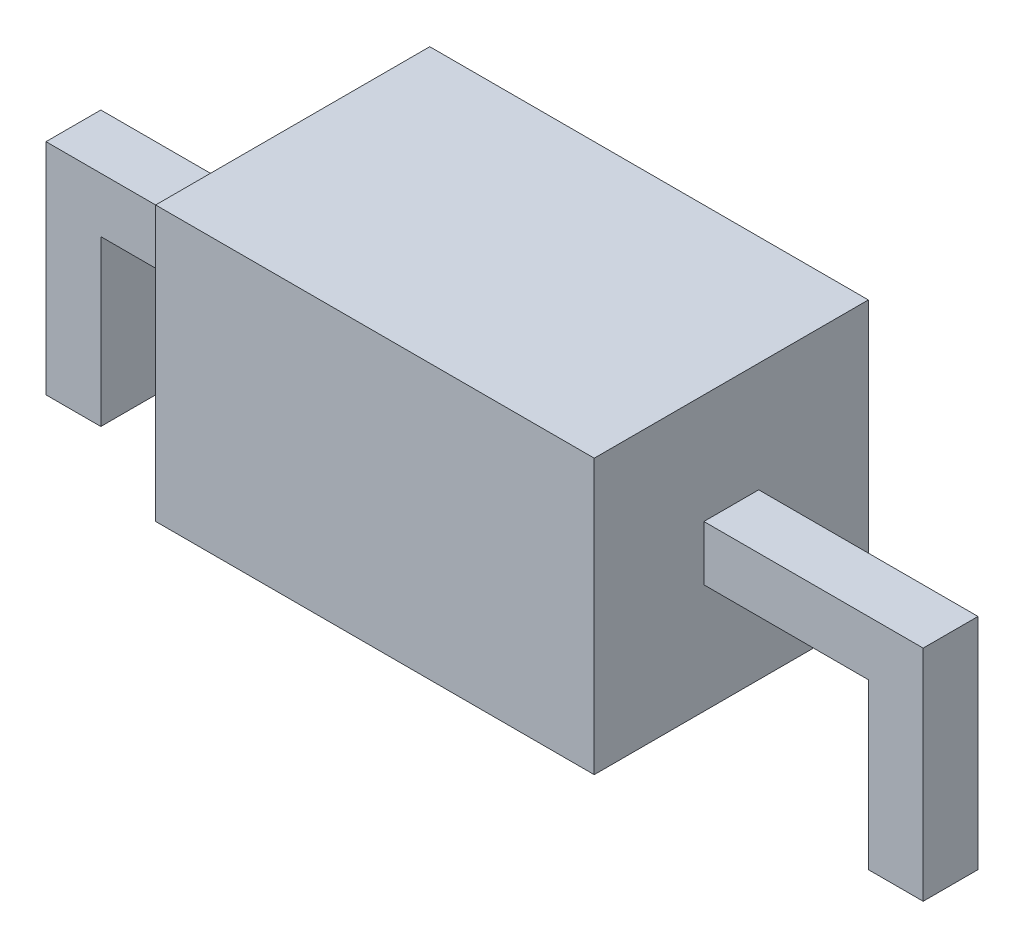
ISO-10303-21;
HEADER;
FILE_DESCRIPTION(('STEP AP214'),'2;1');
FILE_NAME('part.step','',(''),(''),'','','');
FILE_SCHEMA(('AUTOMOTIVE_DESIGN { 1 0 10303 214 1 1 1 1 }'));
ENDSEC;
DATA;
#1=APPLICATION_CONTEXT('core data for automotive mechanical design processes');
#2=APPLICATION_PROTOCOL_DEFINITION('international standard','automotive_design',2000,#1);
#3=PRODUCT_CONTEXT('',#1,'mechanical');
#4=PRODUCT('Part','Part','',(#3));
#5=PRODUCT_RELATED_PRODUCT_CATEGORY('part','',(#4));
#6=PRODUCT_DEFINITION_FORMATION('','',#4);
#7=PRODUCT_DEFINITION_CONTEXT('part definition',#1,'design');
#8=PRODUCT_DEFINITION('design','',#6,#7);
#9=PRODUCT_DEFINITION_SHAPE('','',#8);
#10=(LENGTH_UNIT() NAMED_UNIT(*) SI_UNIT(.MILLI.,.METRE.));
#11=(NAMED_UNIT(*) PLANE_ANGLE_UNIT() SI_UNIT($,.RADIAN.));
#12=(NAMED_UNIT(*) SI_UNIT($,.STERADIAN.) SOLID_ANGLE_UNIT());
#13=UNCERTAINTY_MEASURE_WITH_UNIT(LENGTH_MEASURE(1.E-05),#10,'distance_accuracy_value','');
#14=(GEOMETRIC_REPRESENTATION_CONTEXT(3) GLOBAL_UNCERTAINTY_ASSIGNED_CONTEXT((#13)) GLOBAL_UNIT_ASSIGNED_CONTEXT((#10,
#11,#12)) REPRESENTATION_CONTEXT('',''));
#15=CARTESIAN_POINT('',(0.,0.,0.));
#16=DIRECTION('',(0.,0.,1.));
#17=DIRECTION('',(1.,0.,0.));
#18=AXIS2_PLACEMENT_3D('',#15,#16,#17);
#19=CARTESIAN_POINT('',(2.,1.25,2.5));
#20=DIRECTION('',(-1.,0.,0.));
#21=DIRECTION('',(0.,0.,1.));
#22=AXIS2_PLACEMENT_3D('',#19,#20,#21);
#23=PLANE('',#22);
#24=DIRECTION('',(0.,-1.,0.));
#25=VECTOR('',#24,1.);
#26=CARTESIAN_POINT('',(2.,0.,1.));
#27=LINE('',#26,#25);
#28=CARTESIAN_POINT('',(2.,0.25,1.));
#29=VERTEX_POINT('',#28);
#30=CARTESIAN_POINT('',(2.,-0.25,1.));
#31=VERTEX_POINT('',#30);
#32=EDGE_CURVE('E263',#29,#31,#27,.T.);
#33=ORIENTED_EDGE('',*,*,#32,.T.);
#34=DIRECTION('',(0.,0.,1.));
#35=VECTOR('',#34,1.);
#36=CARTESIAN_POINT('',(2.,-0.25,1.));
#37=LINE('',#36,#35);
#38=CARTESIAN_POINT('',(2.,-0.25,1.5));
#39=VERTEX_POINT('',#38);
#40=EDGE_CURVE('E268',#31,#39,#37,.T.);
#41=ORIENTED_EDGE('',*,*,#40,.T.);
#42=DIRECTION('',(0.,-1.,0.));
#43=VECTOR('',#42,1.);
#44=CARTESIAN_POINT('',(2.,0.,1.5));
#45=LINE('',#44,#43);
#46=CARTESIAN_POINT('',(2.,0.25,1.5));
#47=VERTEX_POINT('',#46);
#48=EDGE_CURVE('E242',#47,#39,#45,.T.);
#49=ORIENTED_EDGE('',*,*,#48,.F.);
#50=DIRECTION('',(0.,0.,1.));
#51=VECTOR('',#50,1.);
#52=CARTESIAN_POINT('',(2.,0.25,1.));
#53=LINE('',#52,#51);
#54=EDGE_CURVE('E273',#29,#47,#53,.T.);
#55=ORIENTED_EDGE('',*,*,#54,.F.);
#56=EDGE_LOOP('',(#33,#41,#49,#55));
#57=FACE_BOUND('',#56,.T.);
#58=DIRECTION('',(0.,1.,0.));
#59=VECTOR('',#58,1.);
#60=CARTESIAN_POINT('',(2.,1.25,0.));
#61=LINE('',#60,#59);
#62=CARTESIAN_POINT('',(2.,-1.25,0.));
#63=VERTEX_POINT('',#62);
#64=CARTESIAN_POINT('',(2.,1.25,0.));
#65=VERTEX_POINT('',#64);
#66=EDGE_CURVE('E272',#63,#65,#61,.T.);
#67=ORIENTED_EDGE('',*,*,#66,.T.);
#68=DIRECTION('',(0.,0.,-1.));
#69=VECTOR('',#68,1.);
#70=CARTESIAN_POINT('',(2.,1.25,2.5));
#71=LINE('',#70,#69);
#72=CARTESIAN_POINT('',(2.,1.25,2.5));
#73=VERTEX_POINT('',#72);
#74=EDGE_CURVE('E11',#73,#65,#71,.T.);
#75=ORIENTED_EDGE('',*,*,#74,.F.);
#76=DIRECTION('',(0.,1.,0.));
#77=VECTOR('',#76,1.);
#78=CARTESIAN_POINT('',(2.,1.25,2.5));
#79=LINE('',#78,#77);
#80=CARTESIAN_POINT('',(2.,-1.25,2.5));
#81=VERTEX_POINT('',#80);
#82=EDGE_CURVE('E287',#81,#73,#79,.T.);
#83=ORIENTED_EDGE('',*,*,#82,.F.);
#84=DIRECTION('',(0.,0.,-1.));
#85=VECTOR('',#84,1.);
#86=CARTESIAN_POINT('',(2.,-1.25,2.5));
#87=LINE('',#86,#85);
#88=EDGE_CURVE('E301',#81,#63,#87,.T.);
#89=ORIENTED_EDGE('',*,*,#88,.T.);
#90=EDGE_LOOP('',(#67,#75,#83,#89));
#91=FACE_BOUND('',#90,.T.);
#92=ADVANCED_FACE('F41',(#57,#91),#23,.F.);
#93=CARTESIAN_POINT('',(-2.,1.25,2.5));
#94=DIRECTION('',(0.,-1.,0.));
#95=DIRECTION('',(0.,0.,-1.));
#96=AXIS2_PLACEMENT_3D('',#93,#94,#95);
#97=PLANE('',#96);
#98=DIRECTION('',(-1.,0.,0.));
#99=VECTOR('',#98,1.);
#100=CARTESIAN_POINT('',(-2.,1.25,0.));
#101=LINE('',#100,#99);
#102=CARTESIAN_POINT('',(-2.,1.25,0.));
#103=VERTEX_POINT('',#102);
#104=EDGE_CURVE('E305',#65,#103,#101,.T.);
#105=ORIENTED_EDGE('',*,*,#104,.T.);
#106=DIRECTION('',(0.,0.,-1.));
#107=VECTOR('',#106,1.);
#108=CARTESIAN_POINT('',(-2.,1.25,2.5));
#109=LINE('',#108,#107);
#110=CARTESIAN_POINT('',(-2.,1.25,2.5));
#111=VERTEX_POINT('',#110);
#112=EDGE_CURVE('E49',#111,#103,#109,.T.);
#113=ORIENTED_EDGE('',*,*,#112,.F.);
#114=DIRECTION('',(-1.,0.,0.));
#115=VECTOR('',#114,1.);
#116=CARTESIAN_POINT('',(-2.,1.25,2.5));
#117=LINE('',#116,#115);
#118=EDGE_CURVE('E291',#73,#111,#117,.T.);
#119=ORIENTED_EDGE('',*,*,#118,.F.);
#120=ORIENTED_EDGE('',*,*,#74,.T.);
#121=EDGE_LOOP('',(#105,#113,#119,#120));
#122=FACE_BOUND('',#121,.T.);
#123=ADVANCED_FACE('F341',(#122),#97,.F.);
#124=CARTESIAN_POINT('',(-2.,1.25,2.5));
#125=DIRECTION('',(1.,0.,0.));
#126=DIRECTION('',(0.,1.,0.));
#127=AXIS2_PLACEMENT_3D('',#124,#125,#126);
#128=PLANE('',#127);
#129=DIRECTION('',(0.,-1.,0.));
#130=VECTOR('',#129,1.);
#131=CARTESIAN_POINT('',(-2.,0.,1.));
#132=LINE('',#131,#130);
#133=CARTESIAN_POINT('',(-2.,0.25,1.));
#134=VERTEX_POINT('',#133);
#135=CARTESIAN_POINT('',(-2.,-0.25,1.));
#136=VERTEX_POINT('',#135);
#137=EDGE_CURVE('E190',#134,#136,#132,.T.);
#138=ORIENTED_EDGE('',*,*,#137,.F.);
#139=DIRECTION('',(0.,0.,1.));
#140=VECTOR('',#139,1.);
#141=CARTESIAN_POINT('',(-2.,0.25,1.));
#142=LINE('',#141,#140);
#143=CARTESIAN_POINT('',(-2.,0.25,1.5));
#144=VERTEX_POINT('',#143);
#145=EDGE_CURVE('E56',#134,#144,#142,.T.);
#146=ORIENTED_EDGE('',*,*,#145,.T.);
#147=DIRECTION('',(0.,-1.,0.));
#148=VECTOR('',#147,1.);
#149=CARTESIAN_POINT('',(-2.,0.,1.5));
#150=LINE('',#149,#148);
#151=CARTESIAN_POINT('',(-2.,-0.25,1.5));
#152=VERTEX_POINT('',#151);
#153=EDGE_CURVE('E61',#144,#152,#150,.T.);
#154=ORIENTED_EDGE('',*,*,#153,.T.);
#155=DIRECTION('',(0.,0.,1.));
#156=VECTOR('',#155,1.);
#157=CARTESIAN_POINT('',(-2.,-0.25,1.));
#158=LINE('',#157,#156);
#159=EDGE_CURVE('E209',#136,#152,#158,.T.);
#160=ORIENTED_EDGE('',*,*,#159,.F.);
#161=EDGE_LOOP('',(#138,#146,#154,#160));
#162=FACE_BOUND('',#161,.T.);
#163=DIRECTION('',(0.,-1.,0.));
#164=VECTOR('',#163,1.);
#165=CARTESIAN_POINT('',(-2.,1.25,0.));
#166=LINE('',#165,#164);
#167=CARTESIAN_POINT('',(-2.,-1.25,0.));
#168=VERTEX_POINT('',#167);
#169=EDGE_CURVE('E308',#103,#168,#166,.T.);
#170=ORIENTED_EDGE('',*,*,#169,.T.);
#171=DIRECTION('',(0.,0.,-1.));
#172=VECTOR('',#171,1.);
#173=CARTESIAN_POINT('',(-2.,-1.25,2.5));
#174=LINE('',#173,#172);
#175=CARTESIAN_POINT('',(-2.,-1.25,2.5));
#176=VERTEX_POINT('',#175);
#177=EDGE_CURVE('E316',#176,#168,#174,.T.);
#178=ORIENTED_EDGE('',*,*,#177,.F.);
#179=DIRECTION('',(0.,-1.,0.));
#180=VECTOR('',#179,1.);
#181=CARTESIAN_POINT('',(-2.,1.25,2.5));
#182=LINE('',#181,#180);
#183=EDGE_CURVE('E295',#111,#176,#182,.T.);
#184=ORIENTED_EDGE('',*,*,#183,.F.);
#185=ORIENTED_EDGE('',*,*,#112,.T.);
#186=EDGE_LOOP('',(#170,#178,#184,#185));
#187=FACE_BOUND('',#186,.T.);
#188=ADVANCED_FACE('F325',(#162,#187),#128,.F.);
#189=CARTESIAN_POINT('',(-2.,-1.25,2.5));
#190=DIRECTION('',(0.,1.,0.));
#191=DIRECTION('',(0.,0.,1.));
#192=AXIS2_PLACEMENT_3D('',#189,#190,#191);
#193=PLANE('',#192);
#194=DIRECTION('',(1.,0.,0.));
#195=VECTOR('',#194,1.);
#196=CARTESIAN_POINT('',(-2.,-1.25,0.));
#197=LINE('',#196,#195);
#198=EDGE_CURVE('E292',#168,#63,#197,.T.);
#199=ORIENTED_EDGE('',*,*,#198,.T.);
#200=ORIENTED_EDGE('',*,*,#88,.F.);
#201=DIRECTION('',(1.,0.,0.));
#202=VECTOR('',#201,1.);
#203=CARTESIAN_POINT('',(-2.,-1.25,2.5));
#204=LINE('',#203,#202);
#205=EDGE_CURVE('E298',#176,#81,#204,.T.);
#206=ORIENTED_EDGE('',*,*,#205,.F.);
#207=ORIENTED_EDGE('',*,*,#177,.T.);
#208=EDGE_LOOP('',(#199,#200,#206,#207));
#209=FACE_BOUND('',#208,.T.);
#210=ADVANCED_FACE('F334',(#209),#193,.F.);
#211=CARTESIAN_POINT('',(0.,0.,2.5));
#212=DIRECTION('',(0.,0.,1.));
#213=DIRECTION('',(1.,0.,0.));
#214=AXIS2_PLACEMENT_3D('',#211,#212,#213);
#215=PLANE('',#214);
#216=ORIENTED_EDGE('',*,*,#82,.T.);
#217=ORIENTED_EDGE('',*,*,#118,.T.);
#218=ORIENTED_EDGE('',*,*,#183,.T.);
#219=ORIENTED_EDGE('',*,*,#205,.T.);
#220=EDGE_LOOP('',(#216,#217,#218,#219));
#221=FACE_BOUND('',#220,.T.);
#222=ADVANCED_FACE('F340',(#221),#215,.T.);
#223=CARTESIAN_POINT('',(0.,0.,0.));
#224=DIRECTION('',(0.,0.,1.));
#225=DIRECTION('',(1.,0.,0.));
#226=AXIS2_PLACEMENT_3D('',#223,#224,#225);
#227=PLANE('',#226);
#228=ORIENTED_EDGE('',*,*,#66,.F.);
#229=ORIENTED_EDGE('',*,*,#198,.F.);
#230=ORIENTED_EDGE('',*,*,#169,.F.);
#231=ORIENTED_EDGE('',*,*,#104,.F.);
#232=EDGE_LOOP('',(#228,#229,#230,#231));
#233=FACE_BOUND('',#232,.T.);
#234=ADVANCED_FACE('F331',(#233),#227,.F.);
#235=CARTESIAN_POINT('',(0.,-0.25,1.));
#236=DIRECTION('',(0.,1.,0.));
#237=DIRECTION('',(-1.,0.,0.));
#238=AXIS2_PLACEMENT_3D('',#235,#236,#237);
#239=PLANE('',#238);
#240=DIRECTION('',(0.,0.,1.));
#241=VECTOR('',#240,1.);
#242=CARTESIAN_POINT('',(3.5,-0.25,1.));
#243=LINE('',#242,#241);
#244=CARTESIAN_POINT('',(3.5,-0.25,1.));
#245=VERTEX_POINT('',#244);
#246=CARTESIAN_POINT('',(3.5,-0.25,1.5));
#247=VERTEX_POINT('',#246);
#248=EDGE_CURVE('E267',#245,#247,#243,.T.);
#249=ORIENTED_EDGE('',*,*,#248,.T.);
#250=DIRECTION('',(-1.,0.,0.));
#251=VECTOR('',#250,1.);
#252=CARTESIAN_POINT('',(0.,-0.25,1.5));
#253=LINE('',#252,#251);
#254=EDGE_CURVE('E212',#247,#39,#253,.T.);
#255=ORIENTED_EDGE('',*,*,#254,.T.);
#256=ORIENTED_EDGE('',*,*,#40,.F.);
#257=DIRECTION('',(-1.,0.,0.));
#258=VECTOR('',#257,1.);
#259=CARTESIAN_POINT('',(0.,-0.25,1.));
#260=LINE('',#259,#258);
#261=EDGE_CURVE('E245',#245,#31,#260,.T.);
#262=ORIENTED_EDGE('',*,*,#261,.F.);
#263=EDGE_LOOP('',(#249,#255,#256,#262));
#264=FACE_BOUND('',#263,.T.);
#265=ADVANCED_FACE('F356',(#264),#239,.F.);
#266=CARTESIAN_POINT('',(0.,0.25,1.));
#267=DIRECTION('',(0.,-1.,0.));
#268=DIRECTION('',(0.,0.,-1.));
#269=AXIS2_PLACEMENT_3D('',#266,#267,#268);
#270=PLANE('',#269);
#271=ORIENTED_EDGE('',*,*,#54,.T.);
#272=DIRECTION('',(1.,0.,0.));
#273=VECTOR('',#272,1.);
#274=CARTESIAN_POINT('',(0.,0.25,1.5));
#275=LINE('',#274,#273);
#276=CARTESIAN_POINT('',(4.,0.25,1.5));
#277=VERTEX_POINT('',#276);
#278=EDGE_CURVE('E238',#47,#277,#275,.T.);
#279=ORIENTED_EDGE('',*,*,#278,.T.);
#280=DIRECTION('',(0.,0.,1.));
#281=VECTOR('',#280,1.);
#282=CARTESIAN_POINT('',(4.,0.25,1.));
#283=LINE('',#282,#281);
#284=CARTESIAN_POINT('',(4.,0.25,1.));
#285=VERTEX_POINT('',#284);
#286=EDGE_CURVE('E276',#285,#277,#283,.T.);
#287=ORIENTED_EDGE('',*,*,#286,.F.);
#288=DIRECTION('',(1.,0.,0.));
#289=VECTOR('',#288,1.);
#290=CARTESIAN_POINT('',(0.,0.25,1.));
#291=LINE('',#290,#289);
#292=EDGE_CURVE('E260',#29,#285,#291,.T.);
#293=ORIENTED_EDGE('',*,*,#292,.F.);
#294=EDGE_LOOP('',(#271,#279,#287,#293));
#295=FACE_BOUND('',#294,.T.);
#296=ADVANCED_FACE('F361',(#295),#270,.F.);
#297=CARTESIAN_POINT('',(4.,0.,1.));
#298=DIRECTION('',(-1.,0.,0.));
#299=DIRECTION('',(0.,0.,1.));
#300=AXIS2_PLACEMENT_3D('',#297,#298,#299);
#301=PLANE('',#300);
#302=ORIENTED_EDGE('',*,*,#286,.T.);
#303=DIRECTION('',(0.,-1.,0.));
#304=VECTOR('',#303,1.);
#305=CARTESIAN_POINT('',(4.,0.,1.5));
#306=LINE('',#305,#304);
#307=CARTESIAN_POINT('',(4.,-1.75,1.5));
#308=VERTEX_POINT('',#307);
#309=EDGE_CURVE('E234',#277,#308,#306,.T.);
#310=ORIENTED_EDGE('',*,*,#309,.T.);
#311=DIRECTION('',(0.,0.,1.));
#312=VECTOR('',#311,1.);
#313=CARTESIAN_POINT('',(4.,-1.75,1.));
#314=LINE('',#313,#312);
#315=CARTESIAN_POINT('',(4.,-1.75,1.));
#316=VERTEX_POINT('',#315);
#317=EDGE_CURVE('E279',#316,#308,#314,.T.);
#318=ORIENTED_EDGE('',*,*,#317,.F.);
#319=DIRECTION('',(0.,-1.,0.));
#320=VECTOR('',#319,1.);
#321=CARTESIAN_POINT('',(4.,0.,1.));
#322=LINE('',#321,#320);
#323=EDGE_CURVE('E257',#285,#316,#322,.T.);
#324=ORIENTED_EDGE('',*,*,#323,.F.);
#325=EDGE_LOOP('',(#302,#310,#318,#324));
#326=FACE_BOUND('',#325,.T.);
#327=ADVANCED_FACE('F371',(#326),#301,.F.);
#328=CARTESIAN_POINT('',(0.,-1.75,1.));
#329=DIRECTION('',(0.,-1.,0.));
#330=DIRECTION('',(0.,0.,-1.));
#331=AXIS2_PLACEMENT_3D('',#328,#329,#330);
#332=PLANE('',#331);
#333=ORIENTED_EDGE('',*,*,#317,.T.);
#334=DIRECTION('',(1.,0.,0.));
#335=VECTOR('',#334,1.);
#336=CARTESIAN_POINT('',(0.,-1.75,1.5));
#337=LINE('',#336,#335);
#338=CARTESIAN_POINT('',(3.5,-1.75,1.5));
#339=VERTEX_POINT('',#338);
#340=EDGE_CURVE('E230',#339,#308,#337,.T.);
#341=ORIENTED_EDGE('',*,*,#340,.F.);
#342=DIRECTION('',(0.,0.,1.));
#343=VECTOR('',#342,1.);
#344=CARTESIAN_POINT('',(3.5,-1.75,1.));
#345=LINE('',#344,#343);
#346=CARTESIAN_POINT('',(3.5,-1.75,1.));
#347=VERTEX_POINT('',#346);
#348=EDGE_CURVE('E282',#347,#339,#345,.T.);
#349=ORIENTED_EDGE('',*,*,#348,.F.);
#350=DIRECTION('',(1.,0.,0.));
#351=VECTOR('',#350,1.);
#352=CARTESIAN_POINT('',(0.,-1.75,1.));
#353=LINE('',#352,#351);
#354=EDGE_CURVE('E253',#347,#316,#353,.T.);
#355=ORIENTED_EDGE('',*,*,#354,.T.);
#356=EDGE_LOOP('',(#333,#341,#349,#355));
#357=FACE_BOUND('',#356,.T.);
#358=ADVANCED_FACE('F367',(#357),#332,.T.);
#359=CARTESIAN_POINT('',(3.5,0.,1.));
#360=DIRECTION('',(-1.,0.,0.));
#361=DIRECTION('',(0.,-1.,0.));
#362=AXIS2_PLACEMENT_3D('',#359,#360,#361);
#363=PLANE('',#362);
#364=ORIENTED_EDGE('',*,*,#348,.T.);
#365=DIRECTION('',(0.,-1.,0.));
#366=VECTOR('',#365,1.);
#367=CARTESIAN_POINT('',(3.5,0.,1.5));
#368=LINE('',#367,#366);
#369=EDGE_CURVE('E226',#247,#339,#368,.T.);
#370=ORIENTED_EDGE('',*,*,#369,.F.);
#371=ORIENTED_EDGE('',*,*,#248,.F.);
#372=DIRECTION('',(0.,-1.,0.));
#373=VECTOR('',#372,1.);
#374=CARTESIAN_POINT('',(3.5,0.,1.));
#375=LINE('',#374,#373);
#376=EDGE_CURVE('E249',#245,#347,#375,.T.);
#377=ORIENTED_EDGE('',*,*,#376,.T.);
#378=EDGE_LOOP('',(#364,#370,#371,#377));
#379=FACE_BOUND('',#378,.T.);
#380=ADVANCED_FACE('F363',(#379),#363,.T.);
#381=CARTESIAN_POINT('',(0.,0.,1.));
#382=DIRECTION('',(0.,0.,1.));
#383=DIRECTION('',(1.,0.,0.));
#384=AXIS2_PLACEMENT_3D('',#381,#382,#383);
#385=PLANE('',#384);
#386=ORIENTED_EDGE('',*,*,#261,.T.);
#387=ORIENTED_EDGE('',*,*,#32,.F.);
#388=ORIENTED_EDGE('',*,*,#292,.T.);
#389=ORIENTED_EDGE('',*,*,#323,.T.);
#390=ORIENTED_EDGE('',*,*,#354,.F.);
#391=ORIENTED_EDGE('',*,*,#376,.F.);
#392=EDGE_LOOP('',(#386,#387,#388,#389,#390,#391));
#393=FACE_BOUND('',#392,.T.);
#394=ADVANCED_FACE('F366',(#393),#385,.F.);
#395=CARTESIAN_POINT('',(0.,0.,1.5));
#396=DIRECTION('',(0.,0.,1.));
#397=DIRECTION('',(1.,0.,0.));
#398=AXIS2_PLACEMENT_3D('',#395,#396,#397);
#399=PLANE('',#398);
#400=ORIENTED_EDGE('',*,*,#254,.F.);
#401=ORIENTED_EDGE('',*,*,#369,.T.);
#402=ORIENTED_EDGE('',*,*,#340,.T.);
#403=ORIENTED_EDGE('',*,*,#309,.F.);
#404=ORIENTED_EDGE('',*,*,#278,.F.);
#405=ORIENTED_EDGE('',*,*,#48,.T.);
#406=EDGE_LOOP('',(#400,#401,#402,#403,#404,#405));
#407=FACE_BOUND('',#406,.T.);
#408=ADVANCED_FACE('F381',(#407),#399,.T.);
#409=CARTESIAN_POINT('',(0.,-0.25,1.));
#410=DIRECTION('',(0.,-1.,0.));
#411=DIRECTION('',(1.,0.,0.));
#412=AXIS2_PLACEMENT_3D('',#409,#410,#411);
#413=PLANE('',#412);
#414=ORIENTED_EDGE('',*,*,#159,.T.);
#415=DIRECTION('',(1.,0.,0.));
#416=VECTOR('',#415,1.);
#417=CARTESIAN_POINT('',(0.,-0.25,1.5));
#418=LINE('',#417,#416);
#419=CARTESIAN_POINT('',(-3.5,-0.25,1.5));
#420=VERTEX_POINT('',#419);
#421=EDGE_CURVE('E187',#420,#152,#418,.T.);
#422=ORIENTED_EDGE('',*,*,#421,.F.);
#423=DIRECTION('',(0.,0.,1.));
#424=VECTOR('',#423,1.);
#425=CARTESIAN_POINT('',(-3.5,-0.25,1.));
#426=LINE('',#425,#424);
#427=CARTESIAN_POINT('',(-3.5,-0.25,1.));
#428=VERTEX_POINT('',#427);
#429=EDGE_CURVE('E213',#428,#420,#426,.T.);
#430=ORIENTED_EDGE('',*,*,#429,.F.);
#431=DIRECTION('',(1.,0.,0.));
#432=VECTOR('',#431,1.);
#433=CARTESIAN_POINT('',(0.,-0.25,1.));
#434=LINE('',#433,#432);
#435=EDGE_CURVE('E205',#428,#136,#434,.T.);
#436=ORIENTED_EDGE('',*,*,#435,.T.);
#437=EDGE_LOOP('',(#414,#422,#430,#436));
#438=FACE_BOUND('',#437,.T.);
#439=ADVANCED_FACE('F385',(#438),#413,.T.);
#440=CARTESIAN_POINT('',(-3.5,0.,1.));
#441=DIRECTION('',(-1.,0.,0.));
#442=DIRECTION('',(0.,-1.,0.));
#443=AXIS2_PLACEMENT_3D('',#440,#441,#442);
#444=PLANE('',#443);
#445=ORIENTED_EDGE('',*,*,#429,.T.);
#446=DIRECTION('',(0.,-1.,0.));
#447=VECTOR('',#446,1.);
#448=CARTESIAN_POINT('',(-3.5,0.,1.5));
#449=LINE('',#448,#447);
#450=CARTESIAN_POINT('',(-3.5,-1.75,1.5));
#451=VERTEX_POINT('',#450);
#452=EDGE_CURVE('E180',#420,#451,#449,.T.);
#453=ORIENTED_EDGE('',*,*,#452,.T.);
#454=DIRECTION('',(0.,0.,1.));
#455=VECTOR('',#454,1.);
#456=CARTESIAN_POINT('',(-3.5,-1.75,1.));
#457=LINE('',#456,#455);
#458=CARTESIAN_POINT('',(-3.5,-1.75,1.));
#459=VERTEX_POINT('',#458);
#460=EDGE_CURVE('E216',#459,#451,#457,.T.);
#461=ORIENTED_EDGE('',*,*,#460,.F.);
#462=DIRECTION('',(0.,-1.,0.));
#463=VECTOR('',#462,1.);
#464=CARTESIAN_POINT('',(-3.5,0.,1.));
#465=LINE('',#464,#463);
#466=EDGE_CURVE('E202',#428,#459,#465,.T.);
#467=ORIENTED_EDGE('',*,*,#466,.F.);
#468=EDGE_LOOP('',(#445,#453,#461,#467));
#469=FACE_BOUND('',#468,.T.);
#470=ADVANCED_FACE('F395',(#469),#444,.F.);
#471=CARTESIAN_POINT('',(0.,-1.75,1.));
#472=DIRECTION('',(0.,1.,0.));
#473=DIRECTION('',(0.,0.,1.));
#474=AXIS2_PLACEMENT_3D('',#471,#472,#473);
#475=PLANE('',#474);
#476=ORIENTED_EDGE('',*,*,#460,.T.);
#477=DIRECTION('',(-1.,0.,0.));
#478=VECTOR('',#477,1.);
#479=CARTESIAN_POINT('',(0.,-1.75,1.5));
#480=LINE('',#479,#478);
#481=CARTESIAN_POINT('',(-4.,-1.75,1.5));
#482=VERTEX_POINT('',#481);
#483=EDGE_CURVE('E177',#451,#482,#480,.T.);
#484=ORIENTED_EDGE('',*,*,#483,.T.);
#485=DIRECTION('',(0.,0.,1.));
#486=VECTOR('',#485,1.);
#487=CARTESIAN_POINT('',(-4.,-1.75,1.));
#488=LINE('',#487,#486);
#489=CARTESIAN_POINT('',(-4.,-1.75,1.));
#490=VERTEX_POINT('',#489);
#491=EDGE_CURVE('E163',#490,#482,#488,.T.);
#492=ORIENTED_EDGE('',*,*,#491,.F.);
#493=DIRECTION('',(-1.,0.,0.));
#494=VECTOR('',#493,1.);
#495=CARTESIAN_POINT('',(0.,-1.75,1.));
#496=LINE('',#495,#494);
#497=EDGE_CURVE('E199',#459,#490,#496,.T.);
#498=ORIENTED_EDGE('',*,*,#497,.F.);
#499=EDGE_LOOP('',(#476,#484,#492,#498));
#500=FACE_BOUND('',#499,.T.);
#501=ADVANCED_FACE('F392',(#500),#475,.F.);
#502=CARTESIAN_POINT('',(-4.,0.,1.));
#503=DIRECTION('',(-1.,0.,0.));
#504=DIRECTION('',(0.,0.,1.));
#505=AXIS2_PLACEMENT_3D('',#502,#503,#504);
#506=PLANE('',#505);
#507=ORIENTED_EDGE('',*,*,#491,.T.);
#508=DIRECTION('',(0.,-1.,0.));
#509=VECTOR('',#508,1.);
#510=CARTESIAN_POINT('',(-4.,0.,1.5));
#511=LINE('',#510,#509);
#512=CARTESIAN_POINT('',(-4.,0.25,1.5));
#513=VERTEX_POINT('',#512);
#514=EDGE_CURVE('E169',#513,#482,#511,.T.);
#515=ORIENTED_EDGE('',*,*,#514,.F.);
#516=DIRECTION('',(0.,0.,1.));
#517=VECTOR('',#516,1.);
#518=CARTESIAN_POINT('',(-4.,0.25,1.));
#519=LINE('',#518,#517);
#520=CARTESIAN_POINT('',(-4.,0.25,1.));
#521=VERTEX_POINT('',#520);
#522=EDGE_CURVE('E152',#521,#513,#519,.T.);
#523=ORIENTED_EDGE('',*,*,#522,.F.);
#524=DIRECTION('',(0.,-1.,0.));
#525=VECTOR('',#524,1.);
#526=CARTESIAN_POINT('',(-4.,0.,1.));
#527=LINE('',#526,#525);
#528=EDGE_CURVE('E196',#521,#490,#527,.T.);
#529=ORIENTED_EDGE('',*,*,#528,.T.);
#530=EDGE_LOOP('',(#507,#515,#523,#529));
#531=FACE_BOUND('',#530,.T.);
#532=ADVANCED_FACE('F174',(#531),#506,.T.);
#533=CARTESIAN_POINT('',(0.,0.25,1.));
#534=DIRECTION('',(0.,1.,0.));
#535=DIRECTION('',(0.,0.,1.));
#536=AXIS2_PLACEMENT_3D('',#533,#534,#535);
#537=PLANE('',#536);
#538=ORIENTED_EDGE('',*,*,#522,.T.);
#539=DIRECTION('',(-1.,0.,0.));
#540=VECTOR('',#539,1.);
#541=CARTESIAN_POINT('',(0.,0.25,1.5));
#542=LINE('',#541,#540);
#543=EDGE_CURVE('E155',#144,#513,#542,.T.);
#544=ORIENTED_EDGE('',*,*,#543,.F.);
#545=ORIENTED_EDGE('',*,*,#145,.F.);
#546=DIRECTION('',(-1.,0.,0.));
#547=VECTOR('',#546,1.);
#548=CARTESIAN_POINT('',(0.,0.25,1.));
#549=LINE('',#548,#547);
#550=EDGE_CURVE('E157',#134,#521,#549,.T.);
#551=ORIENTED_EDGE('',*,*,#550,.T.);
#552=EDGE_LOOP('',(#538,#544,#545,#551));
#553=FACE_BOUND('',#552,.T.);
#554=ADVANCED_FACE('F154',(#553),#537,.T.);
#555=CARTESIAN_POINT('',(0.,0.,1.));
#556=DIRECTION('',(0.,0.,1.));
#557=DIRECTION('',(1.,0.,0.));
#558=AXIS2_PLACEMENT_3D('',#555,#556,#557);
#559=PLANE('',#558);
#560=ORIENTED_EDGE('',*,*,#137,.T.);
#561=ORIENTED_EDGE('',*,*,#435,.F.);
#562=ORIENTED_EDGE('',*,*,#466,.T.);
#563=ORIENTED_EDGE('',*,*,#497,.T.);
#564=ORIENTED_EDGE('',*,*,#528,.F.);
#565=ORIENTED_EDGE('',*,*,#550,.F.);
#566=EDGE_LOOP('',(#560,#561,#562,#563,#564,#565));
#567=FACE_BOUND('',#566,.T.);
#568=ADVANCED_FACE('F389',(#567),#559,.F.);
#569=CARTESIAN_POINT('',(0.,0.,1.5));
#570=DIRECTION('',(0.,0.,1.));
#571=DIRECTION('',(1.,0.,0.));
#572=AXIS2_PLACEMENT_3D('',#569,#570,#571);
#573=PLANE('',#572);
#574=ORIENTED_EDGE('',*,*,#153,.F.);
#575=ORIENTED_EDGE('',*,*,#543,.T.);
#576=ORIENTED_EDGE('',*,*,#514,.T.);
#577=ORIENTED_EDGE('',*,*,#483,.F.);
#578=ORIENTED_EDGE('',*,*,#452,.F.);
#579=ORIENTED_EDGE('',*,*,#421,.T.);
#580=EDGE_LOOP('',(#574,#575,#576,#577,#578,#579));
#581=FACE_BOUND('',#580,.T.);
#582=ADVANCED_FACE('F167',(#581),#573,.T.);
#583=CLOSED_SHELL('',(#92,#123,#188,#210,#222,#234,#265,#296,#327,#358,#380,#394,#408,#439,#470,
#501,#532,#554,#568,#582));
#584=MANIFOLD_SOLID_BREP('B2',#583);
#585=ADVANCED_BREP_SHAPE_REPRESENTATION('',(#18,#584),#14);
#586=SHAPE_DEFINITION_REPRESENTATION(#9,#585);
ENDSEC;
END-ISO-10303-21;
